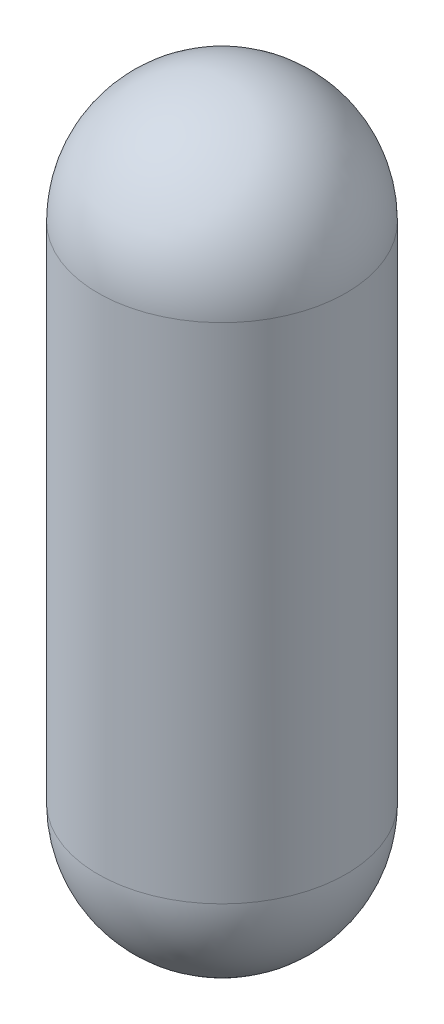
ISO-10303-21;
HEADER;
FILE_DESCRIPTION(('STEP AP214'),'2;1');
FILE_NAME('part.step','',(''),(''),'','','');
FILE_SCHEMA(('AUTOMOTIVE_DESIGN { 1 0 10303 214 1 1 1 1 }'));
ENDSEC;
DATA;
#1=APPLICATION_CONTEXT('core data for automotive mechanical design processes');
#2=APPLICATION_PROTOCOL_DEFINITION('international standard','automotive_design',2000,#1);
#3=PRODUCT_CONTEXT('',#1,'mechanical');
#4=PRODUCT('Part','Part','',(#3));
#5=PRODUCT_RELATED_PRODUCT_CATEGORY('part','',(#4));
#6=PRODUCT_DEFINITION_FORMATION('','',#4);
#7=PRODUCT_DEFINITION_CONTEXT('part definition',#1,'design');
#8=PRODUCT_DEFINITION('design','',#6,#7);
#9=PRODUCT_DEFINITION_SHAPE('','',#8);
#10=(LENGTH_UNIT() NAMED_UNIT(*) SI_UNIT(.MILLI.,.METRE.));
#11=(NAMED_UNIT(*) PLANE_ANGLE_UNIT() SI_UNIT($,.RADIAN.));
#12=(NAMED_UNIT(*) SI_UNIT($,.STERADIAN.) SOLID_ANGLE_UNIT());
#13=UNCERTAINTY_MEASURE_WITH_UNIT(LENGTH_MEASURE(1.E-05),#10,'distance_accuracy_value','');
#14=(GEOMETRIC_REPRESENTATION_CONTEXT(3) GLOBAL_UNCERTAINTY_ASSIGNED_CONTEXT((#13)) GLOBAL_UNIT_ASSIGNED_CONTEXT((#10,
#11,#12)) REPRESENTATION_CONTEXT('',''));
#15=CARTESIAN_POINT('',(0.,0.,0.));
#16=DIRECTION('',(0.,0.,1.));
#17=DIRECTION('',(1.,0.,0.));
#18=AXIS2_PLACEMENT_3D('',#15,#16,#17);
#19=CARTESIAN_POINT('',(-1.11022302462516E-13,1339.6,0.));
#20=DIRECTION('',(0.,-1.,0.));
#21=DIRECTION('',(1.,0.,0.));
#22=AXIS2_PLACEMENT_3D('',#19,#20,#21);
#23=SPHERICAL_SURFACE('',#22,330.2);
#24=CARTESIAN_POINT('',(0.,1339.6,0.));
#25=DIRECTION('',(0.,-1.,0.));
#26=DIRECTION('',(0.,0.,-1.));
#27=AXIS2_PLACEMENT_3D('',#24,#25,#26);
#28=CIRCLE('',#27,330.2);
#29=CARTESIAN_POINT('',(0.,1339.6,-330.2));
#30=VERTEX_POINT('',#29);
#31=EDGE_CURVE('E55',#30,#30,#28,.T.);
#32=ORIENTED_EDGE('',*,*,#31,.F.);
#33=EDGE_LOOP('',(#32));
#34=FACE_BOUND('',#33,.T.);
#35=ADVANCED_FACE('F40',(#34),#23,.T.);
#36=CARTESIAN_POINT('',(0.,0.,0.));
#37=DIRECTION('',(0.,-1.,0.));
#38=DIRECTION('',(-1.,0.,0.));
#39=AXIS2_PLACEMENT_3D('',#36,#37,#38);
#40=SPHERICAL_SURFACE('',#39,330.2);
#41=CARTESIAN_POINT('',(0.,0.,0.));
#42=DIRECTION('',(0.,-1.,0.));
#43=DIRECTION('',(0.,0.,-1.));
#44=AXIS2_PLACEMENT_3D('',#41,#42,#43);
#45=CIRCLE('',#44,330.2);
#46=CARTESIAN_POINT('',(0.,0.,-330.2));
#47=VERTEX_POINT('',#46);
#48=EDGE_CURVE('E51',#47,#47,#45,.T.);
#49=ORIENTED_EDGE('',*,*,#48,.T.);
#50=EDGE_LOOP('',(#49));
#51=FACE_BOUND('',#50,.T.);
#52=ADVANCED_FACE('F65',(#51),#40,.T.);
#53=CARTESIAN_POINT('',(0.,0.,0.));
#54=DIRECTION('',(0.,-1.,0.));
#55=DIRECTION('',(0.,0.,-1.));
#56=AXIS2_PLACEMENT_3D('',#53,#54,#55);
#57=CYLINDRICAL_SURFACE('',#56,330.2);
#58=ORIENTED_EDGE('',*,*,#31,.T.);
#59=EDGE_LOOP('',(#58));
#60=FACE_BOUND('',#59,.T.);
#61=ORIENTED_EDGE('',*,*,#48,.F.);
#62=EDGE_LOOP('',(#61));
#63=FACE_BOUND('',#62,.T.);
#64=ADVANCED_FACE('F61',(#60,#63),#57,.T.);
#65=CLOSED_SHELL('',(#35,#52,#64));
#66=CARTESIAN_POINT('',(-1.2490009027033E-13,1339.6,0.));
#67=DIRECTION('',(0.,-1.,0.));
#68=DIRECTION('',(1.,0.,0.));
#69=AXIS2_PLACEMENT_3D('',#66,#67,#68);
#70=SPHERICAL_SURFACE('',#69,327.66);
#71=CARTESIAN_POINT('',(0.,1339.6,0.));
#72=DIRECTION('',(0.,-1.,0.));
#73=DIRECTION('',(0.,0.,-1.));
#74=AXIS2_PLACEMENT_3D('',#71,#72,#73);
#75=CIRCLE('',#74,327.66);
#76=CARTESIAN_POINT('',(0.,1339.6,-327.66));
#77=VERTEX_POINT('',#76);
#78=EDGE_CURVE('E10',#77,#77,#75,.T.);
#79=ORIENTED_EDGE('',*,*,#78,.T.);
#80=EDGE_LOOP('',(#79));
#81=FACE_BOUND('',#80,.T.);
#82=ADVANCED_FACE('F83',(#81),#70,.F.);
#83=CARTESIAN_POINT('',(0.,0.,0.));
#84=DIRECTION('',(0.,-1.,0.));
#85=DIRECTION('',(0.,0.,-1.));
#86=AXIS2_PLACEMENT_3D('',#83,#84,#85);
#87=CYLINDRICAL_SURFACE('',#86,327.66);
#88=CARTESIAN_POINT('',(0.,0.,0.));
#89=DIRECTION('',(0.,-1.,0.));
#90=DIRECTION('',(0.,0.,-1.));
#91=AXIS2_PLACEMENT_3D('',#88,#89,#90);
#92=CIRCLE('',#91,327.66);
#93=CARTESIAN_POINT('',(0.,0.,-327.66));
#94=VERTEX_POINT('',#93);
#95=EDGE_CURVE('E47',#94,#94,#92,.T.);
#96=ORIENTED_EDGE('',*,*,#95,.T.);
#97=EDGE_LOOP('',(#96));
#98=FACE_BOUND('',#97,.T.);
#99=ORIENTED_EDGE('',*,*,#78,.F.);
#100=EDGE_LOOP('',(#99));
#101=FACE_BOUND('',#100,.T.);
#102=ADVANCED_FACE('F79',(#98,#101),#87,.F.);
#103=CARTESIAN_POINT('',(0.,0.,0.));
#104=DIRECTION('',(0.,-1.,0.));
#105=DIRECTION('',(1.,0.,0.));
#106=AXIS2_PLACEMENT_3D('',#103,#104,#105);
#107=SPHERICAL_SURFACE('',#106,327.66);
#108=ORIENTED_EDGE('',*,*,#95,.F.);
#109=EDGE_LOOP('',(#108));
#110=FACE_BOUND('',#109,.T.);
#111=ADVANCED_FACE('F76',(#110),#107,.F.);
#112=CLOSED_SHELL('',(#82,#102,#111));
#113=ORIENTED_CLOSED_SHELL('',*,#112,.T.);
#114=BREP_WITH_VOIDS('B2',#65,(#113));
#115=ADVANCED_BREP_SHAPE_REPRESENTATION('',(#18,#114),#14);
#116=SHAPE_DEFINITION_REPRESENTATION(#9,#115);
ENDSEC;
END-ISO-10303-21;
